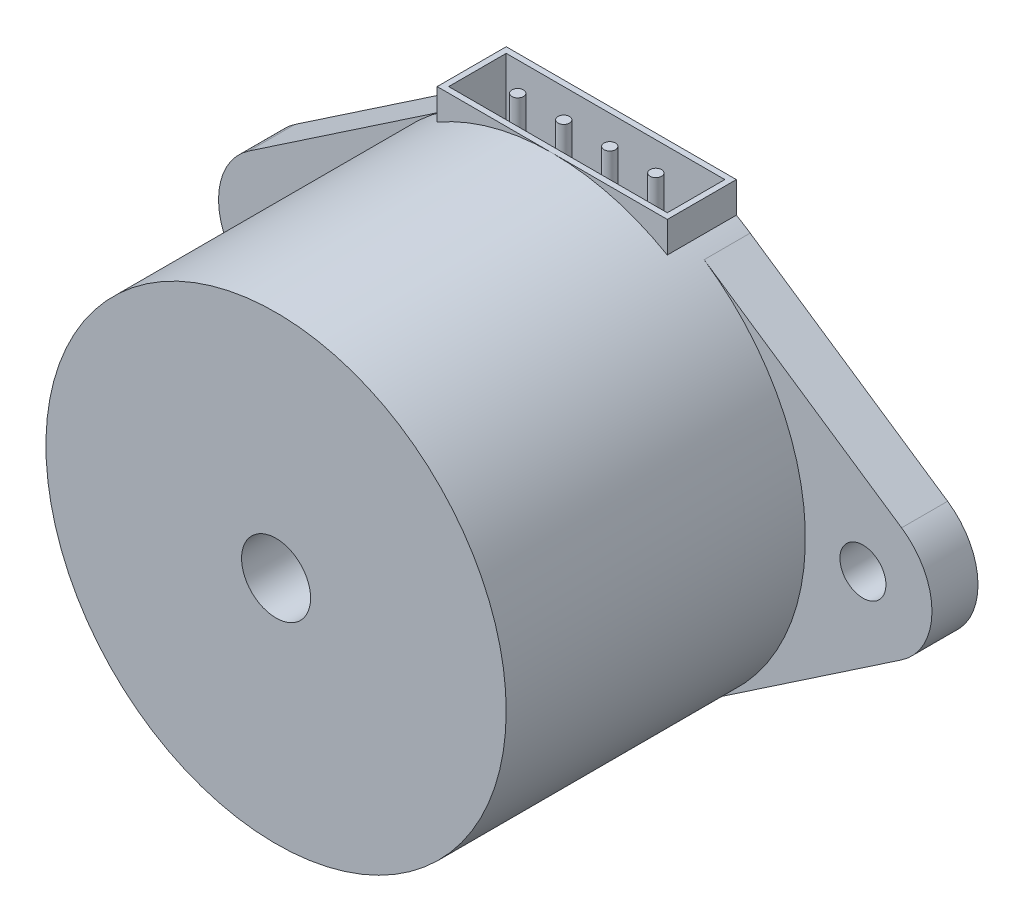
ISO-10303-21;
HEADER;
FILE_DESCRIPTION(('STEP AP214'),'2;1');
FILE_NAME('part.step','',(''),(''),'','','');
FILE_SCHEMA(('AUTOMOTIVE_DESIGN { 1 0 10303 214 1 1 1 1 }'));
ENDSEC;
DATA;
#1=APPLICATION_CONTEXT('core data for automotive mechanical design processes');
#2=APPLICATION_PROTOCOL_DEFINITION('international standard','automotive_design',2000,#1);
#3=PRODUCT_CONTEXT('',#1,'mechanical');
#4=PRODUCT('Part','Part','',(#3));
#5=PRODUCT_RELATED_PRODUCT_CATEGORY('part','',(#4));
#6=PRODUCT_DEFINITION_FORMATION('','',#4);
#7=PRODUCT_DEFINITION_CONTEXT('part definition',#1,'design');
#8=PRODUCT_DEFINITION('design','',#6,#7);
#9=PRODUCT_DEFINITION_SHAPE('','',#8);
#10=(LENGTH_UNIT() NAMED_UNIT(*) SI_UNIT(.MILLI.,.METRE.));
#11=(NAMED_UNIT(*) PLANE_ANGLE_UNIT() SI_UNIT($,.RADIAN.));
#12=(NAMED_UNIT(*) SI_UNIT($,.STERADIAN.) SOLID_ANGLE_UNIT());
#13=UNCERTAINTY_MEASURE_WITH_UNIT(LENGTH_MEASURE(1.E-05),#10,'distance_accuracy_value','');
#14=(GEOMETRIC_REPRESENTATION_CONTEXT(3) GLOBAL_UNCERTAINTY_ASSIGNED_CONTEXT((#13)) GLOBAL_UNIT_ASSIGNED_CONTEXT((#10,
#11,#12)) REPRESENTATION_CONTEXT('',''));
#15=CARTESIAN_POINT('',(0.,0.,0.));
#16=DIRECTION('',(0.,0.,1.));
#17=DIRECTION('',(1.,0.,0.));
#18=AXIS2_PLACEMENT_3D('',#15,#16,#17);
#19=CARTESIAN_POINT('',(0.,10.,0.));
#20=DIRECTION('',(0.,1.,0.));
#21=DIRECTION('',(0.,0.,1.));
#22=AXIS2_PLACEMENT_3D('',#19,#20,#21);
#23=PLANE('',#22);
#24=DIRECTION('',(-1.,0.,0.));
#25=VECTOR('',#24,1.);
#26=CARTESIAN_POINT('',(-5.,10.,0.));
#27=LINE('',#26,#25);
#28=CARTESIAN_POINT('',(5.,10.,0.));
#29=VERTEX_POINT('',#28);
#30=CARTESIAN_POINT('',(-5.,10.,0.));
#31=VERTEX_POINT('',#30);
#32=EDGE_CURVE('E248',#29,#31,#27,.T.);
#33=ORIENTED_EDGE('',*,*,#32,.T.);
#34=DIRECTION('',(0.,0.,1.));
#35=VECTOR('',#34,1.);
#36=CARTESIAN_POINT('',(-5.,10.,0.));
#37=LINE('',#36,#35);
#38=CARTESIAN_POINT('',(-5.,10.,3.));
#39=VERTEX_POINT('',#38);
#40=EDGE_CURVE('E230',#31,#39,#37,.T.);
#41=ORIENTED_EDGE('',*,*,#40,.T.);
#42=DIRECTION('',(1.,0.,0.));
#43=VECTOR('',#42,1.);
#44=CARTESIAN_POINT('',(-5.,10.,3.));
#45=LINE('',#44,#43);
#46=CARTESIAN_POINT('',(0.,10.,3.));
#47=VERTEX_POINT('',#46);
#48=EDGE_CURVE('E240',#39,#47,#45,.T.);
#49=ORIENTED_EDGE('',*,*,#48,.T.);
#50=CARTESIAN_POINT('',(5.,10.,3.));
#51=VERTEX_POINT('',#50);
#52=EDGE_CURVE('E239',#47,#51,#45,.T.);
#53=ORIENTED_EDGE('',*,*,#52,.T.);
#54=DIRECTION('',(0.,0.,-1.));
#55=VECTOR('',#54,1.);
#56=CARTESIAN_POINT('',(5.,10.,0.));
#57=LINE('',#56,#55);
#58=EDGE_CURVE('E244',#51,#29,#57,.T.);
#59=ORIENTED_EDGE('',*,*,#58,.T.);
#60=EDGE_LOOP('',(#33,#41,#49,#53,#59));
#61=FACE_BOUND('',#60,.T.);
#62=DIRECTION('',(1.,0.,0.));
#63=VECTOR('',#62,1.);
#64=CARTESIAN_POINT('',(0.,10.,0.25));
#65=LINE('',#64,#63);
#66=CARTESIAN_POINT('',(-4.75,10.,0.25));
#67=VERTEX_POINT('',#66);
#68=CARTESIAN_POINT('',(4.75,10.,0.25));
#69=VERTEX_POINT('',#68);
#70=EDGE_CURVE('E215',#67,#69,#65,.T.);
#71=ORIENTED_EDGE('',*,*,#70,.T.);
#72=DIRECTION('',(0.,0.,1.));
#73=VECTOR('',#72,1.);
#74=CARTESIAN_POINT('',(4.75,10.,0.));
#75=LINE('',#74,#73);
#76=CARTESIAN_POINT('',(4.75,10.,2.75));
#77=VERTEX_POINT('',#76);
#78=EDGE_CURVE('E60',#69,#77,#75,.T.);
#79=ORIENTED_EDGE('',*,*,#78,.T.);
#80=DIRECTION('',(1.,0.,0.));
#81=VECTOR('',#80,1.);
#82=CARTESIAN_POINT('',(0.,10.,2.75));
#83=LINE('',#82,#81);
#84=CARTESIAN_POINT('',(-4.75,10.,2.75));
#85=VERTEX_POINT('',#84);
#86=EDGE_CURVE('E222',#85,#77,#83,.T.);
#87=ORIENTED_EDGE('',*,*,#86,.F.);
#88=DIRECTION('',(0.,0.,1.));
#89=VECTOR('',#88,1.);
#90=CARTESIAN_POINT('',(-4.75,10.,0.));
#91=LINE('',#90,#89);
#92=EDGE_CURVE('E218',#67,#85,#91,.T.);
#93=ORIENTED_EDGE('',*,*,#92,.F.);
#94=EDGE_LOOP('',(#71,#79,#87,#93));
#95=FACE_BOUND('',#94,.T.);
#96=ADVANCED_FACE('F44',(#61,#95),#23,.T.);
#97=CARTESIAN_POINT('',(0.,0.,15.));
#98=DIRECTION('',(0.,0.,-1.));
#99=DIRECTION('',(-1.,0.,0.));
#100=AXIS2_PLACEMENT_3D('',#97,#98,#99);
#101=CYLINDRICAL_SURFACE('',#100,10.);
#102=CARTESIAN_POINT('',(0.,0.,0.));
#103=DIRECTION('',(0.,0.,1.));
#104=DIRECTION('',(1.,0.,0.));
#105=AXIS2_PLACEMENT_3D('',#102,#103,#104);
#106=CIRCLE('',#105,10.);
#107=CARTESIAN_POINT('',(5.59999996604207,8.28492607486053,0.));
#108=VERTEX_POINT('',#107);
#109=CARTESIAN_POINT('',(5.,8.66025403784439,0.));
#110=VERTEX_POINT('',#109);
#111=EDGE_CURVE('E367',#108,#110,#106,.T.);
#112=ORIENTED_EDGE('',*,*,#111,.T.);
#113=DIRECTION('',(0.,0.,-1.));
#114=VECTOR('',#113,1.);
#115=CARTESIAN_POINT('',(5.,8.66025403784438,15.));
#116=LINE('',#115,#114);
#117=CARTESIAN_POINT('',(5.,8.66025403784439,3.));
#118=VERTEX_POINT('',#117);
#119=EDGE_CURVE('E255',#110,#118,#116,.F.);
#120=ORIENTED_EDGE('',*,*,#119,.T.);
#121=CARTESIAN_POINT('',(0.,0.,3.));
#122=DIRECTION('',(0.,0.,1.));
#123=DIRECTION('',(1.,0.,0.));
#124=AXIS2_PLACEMENT_3D('',#121,#122,#123);
#125=CIRCLE('',#124,10.);
#126=EDGE_CURVE('E11',#118,#47,#125,.T.);
#127=ORIENTED_EDGE('',*,*,#126,.T.);
#128=CARTESIAN_POINT('',(-5.,8.66025403784439,3.));
#129=VERTEX_POINT('',#128);
#130=EDGE_CURVE('E48',#47,#129,#125,.T.);
#131=ORIENTED_EDGE('',*,*,#130,.T.);
#132=DIRECTION('',(0.,0.,-1.));
#133=VECTOR('',#132,1.);
#134=CARTESIAN_POINT('',(-5.,8.66025403784439,15.));
#135=LINE('',#134,#133);
#136=CARTESIAN_POINT('',(-5.,8.66025403784439,0.));
#137=VERTEX_POINT('',#136);
#138=EDGE_CURVE('E267',#129,#137,#135,.T.);
#139=ORIENTED_EDGE('',*,*,#138,.T.);
#140=CARTESIAN_POINT('',(-5.59999995723817,8.28492606183559,0.));
#141=VERTEX_POINT('',#140);
#142=EDGE_CURVE('E370',#137,#141,#106,.T.);
#143=ORIENTED_EDGE('',*,*,#142,.T.);
#144=DIRECTION('',(0.,0.,-1.));
#145=VECTOR('',#144,1.);
#146=CARTESIAN_POINT('',(-5.59999996604207,8.28492607486053,2.));
#147=LINE('',#146,#145);
#148=CARTESIAN_POINT('',(-5.59999995723817,8.28492606183559,2.));
#149=VERTEX_POINT('',#148);
#150=EDGE_CURVE('E353',#149,#141,#147,.T.);
#151=ORIENTED_EDGE('',*,*,#150,.F.);
#152=CARTESIAN_POINT('',(0.,0.,2.));
#153=DIRECTION('',(0.,0.,-1.));
#154=DIRECTION('',(-1.,0.,0.));
#155=AXIS2_PLACEMENT_3D('',#152,#153,#154);
#156=CIRCLE('',#155,10.);
#157=CARTESIAN_POINT('',(-5.59999995723811,-8.28492606183558,2.));
#158=VERTEX_POINT('',#157);
#159=EDGE_CURVE('E366',#158,#149,#156,.T.);
#160=ORIENTED_EDGE('',*,*,#159,.F.);
#161=DIRECTION('',(0.,0.,-1.));
#162=VECTOR('',#161,1.);
#163=CARTESIAN_POINT('',(-5.59999996604202,-8.28492607486053,2.));
#164=LINE('',#163,#162);
#165=CARTESIAN_POINT('',(-5.59999996604202,-8.28492607486053,0.));
#166=VERTEX_POINT('',#165);
#167=EDGE_CURVE('E334',#158,#166,#164,.T.);
#168=ORIENTED_EDGE('',*,*,#167,.T.);
#169=CARTESIAN_POINT('',(5.59999995723818,-8.28492606183553,0.));
#170=VERTEX_POINT('',#169);
#171=EDGE_CURVE('E338',#166,#170,#106,.T.);
#172=ORIENTED_EDGE('',*,*,#171,.T.);
#173=DIRECTION('',(0.,0.,-1.));
#174=VECTOR('',#173,1.);
#175=CARTESIAN_POINT('',(5.59999996604209,-8.28492607486049,2.));
#176=LINE('',#175,#174);
#177=CARTESIAN_POINT('',(5.599999974846,-8.28492608788544,2.));
#178=VERTEX_POINT('',#177);
#179=EDGE_CURVE('E339',#178,#170,#176,.T.);
#180=ORIENTED_EDGE('',*,*,#179,.F.);
#181=CARTESIAN_POINT('',(5.59999995723817,8.28492606183559,2.));
#182=VERTEX_POINT('',#181);
#183=EDGE_CURVE('E373',#182,#178,#156,.T.);
#184=ORIENTED_EDGE('',*,*,#183,.F.);
#185=DIRECTION('',(0.,0.,-1.));
#186=VECTOR('',#185,1.);
#187=CARTESIAN_POINT('',(5.59999996604207,8.28492607486053,2.));
#188=LINE('',#187,#186);
#189=EDGE_CURVE('E349',#182,#108,#188,.T.);
#190=ORIENTED_EDGE('',*,*,#189,.T.);
#191=EDGE_LOOP('',(#112,#120,#127,#131,#139,#143,#151,#160,#168,#172,#180,#184,#190));
#192=FACE_BOUND('',#191,.T.);
#193=CARTESIAN_POINT('',(0.,0.,15.));
#194=DIRECTION('',(0.,0.,1.));
#195=DIRECTION('',(1.,0.,0.));
#196=AXIS2_PLACEMENT_3D('',#193,#194,#195);
#197=CIRCLE('',#196,10.);
#198=CARTESIAN_POINT('',(10.,0.,15.));
#199=VERTEX_POINT('',#198);
#200=EDGE_CURVE('E362',#199,#199,#197,.T.);
#201=ORIENTED_EDGE('',*,*,#200,.F.);
#202=EDGE_LOOP('',(#201));
#203=FACE_BOUND('',#202,.T.);
#204=ADVANCED_FACE('F46',(#192,#203),#101,.T.);
#205=CARTESIAN_POINT('',(0.,0.,15.));
#206=DIRECTION('',(0.,0.,1.));
#207=DIRECTION('',(1.,0.,0.));
#208=AXIS2_PLACEMENT_3D('',#205,#206,#207);
#209=PLANE('',#208);
#210=CARTESIAN_POINT('',(0.,0.,15.));
#211=DIRECTION('',(0.,0.,1.));
#212=DIRECTION('',(1.,0.,0.));
#213=AXIS2_PLACEMENT_3D('',#210,#211,#212);
#214=CIRCLE('',#213,1.5);
#215=CARTESIAN_POINT('',(1.5,0.,15.));
#216=VERTEX_POINT('',#215);
#217=EDGE_CURVE('E500',#216,#216,#214,.T.);
#218=ORIENTED_EDGE('',*,*,#217,.F.);
#219=EDGE_LOOP('',(#218));
#220=FACE_BOUND('',#219,.T.);
#221=ORIENTED_EDGE('',*,*,#200,.T.);
#222=EDGE_LOOP('',(#221));
#223=FACE_BOUND('',#222,.T.);
#224=ADVANCED_FACE('F440',(#220,#223),#209,.T.);
#225=CARTESIAN_POINT('',(0.,0.,0.));
#226=DIRECTION('',(0.,0.,1.));
#227=DIRECTION('',(1.,0.,0.));
#228=AXIS2_PLACEMENT_3D('',#225,#226,#227);
#229=PLANE('',#228);
#230=ORIENTED_EDGE('',*,*,#142,.F.);
#231=DIRECTION('',(0.,1.,0.));
#232=VECTOR('',#231,1.);
#233=CARTESIAN_POINT('',(-5.,8.,0.));
#234=LINE('',#233,#232);
#235=EDGE_CURVE('E251',#137,#31,#234,.T.);
#236=ORIENTED_EDGE('',*,*,#235,.T.);
#237=ORIENTED_EDGE('',*,*,#32,.F.);
#238=DIRECTION('',(0.,1.,0.));
#239=VECTOR('',#238,1.);
#240=CARTESIAN_POINT('',(5.,8.,0.));
#241=LINE('',#240,#239);
#242=EDGE_CURVE('E256',#110,#29,#241,.T.);
#243=ORIENTED_EDGE('',*,*,#242,.F.);
#244=ORIENTED_EDGE('',*,*,#111,.F.);
#245=DIRECTION('',(0.828492608788547,-0.559999997484597,0.));
#246=VECTOR('',#245,1.);
#247=CARTESIAN_POINT('',(5.59999995723817,8.28492606183559,0.));
#248=LINE('',#247,#246);
#249=CARTESIAN_POINT('',(14.1799998731342,2.48547764983827,0.));
#250=VERTEX_POINT('',#249);
#251=EDGE_CURVE('E315',#108,#250,#248,.T.);
#252=ORIENTED_EDGE('',*,*,#251,.T.);
#253=CARTESIAN_POINT('',(12.5,0.,0.));
#254=DIRECTION('',(0.,0.,-1.));
#255=DIRECTION('',(-1.,0.,0.));
#256=AXIS2_PLACEMENT_3D('',#253,#254,#255);
#257=CIRCLE('',#256,2.99999957385878);
#258=CARTESIAN_POINT('',(14.1799998731343,-2.48547764983815,0.));
#259=VERTEX_POINT('',#258);
#260=EDGE_CURVE('E319',#250,#259,#257,.T.);
#261=ORIENTED_EDGE('',*,*,#260,.T.);
#262=DIRECTION('',(0.828492608788544,0.5599999974846,0.));
#263=VECTOR('',#262,1.);
#264=CARTESIAN_POINT('',(5.59999995723818,-8.28492606183553,0.));
#265=LINE('',#264,#263);
#266=EDGE_CURVE('E323',#170,#259,#265,.T.);
#267=ORIENTED_EDGE('',*,*,#266,.F.);
#268=ORIENTED_EDGE('',*,*,#171,.F.);
#269=DIRECTION('',(-0.828492608788549,0.559999997484593,0.));
#270=VECTOR('',#269,1.);
#271=CARTESIAN_POINT('',(-5.59999995723811,-8.28492606183558,0.));
#272=LINE('',#271,#270);
#273=CARTESIAN_POINT('',(-14.1799998731342,-2.48547764983826,0.));
#274=VERTEX_POINT('',#273);
#275=EDGE_CURVE('E271',#166,#274,#272,.T.);
#276=ORIENTED_EDGE('',*,*,#275,.T.);
#277=CARTESIAN_POINT('',(-12.5,0.,0.));
#278=DIRECTION('',(0.,0.,-1.));
#279=DIRECTION('',(-1.,0.,0.));
#280=AXIS2_PLACEMENT_3D('',#277,#278,#279);
#281=CIRCLE('',#280,2.99999957385878);
#282=CARTESIAN_POINT('',(-14.1799998731342,2.48547764983825,0.));
#283=VERTEX_POINT('',#282);
#284=EDGE_CURVE('E307',#274,#283,#281,.T.);
#285=ORIENTED_EDGE('',*,*,#284,.T.);
#286=DIRECTION('',(-0.828492608788547,-0.559999997484597,0.));
#287=VECTOR('',#286,1.);
#288=CARTESIAN_POINT('',(-5.59999995723817,8.28492606183559,0.));
#289=LINE('',#288,#287);
#290=EDGE_CURVE('E311',#141,#283,#289,.T.);
#291=ORIENTED_EDGE('',*,*,#290,.F.);
#292=EDGE_LOOP('',(#230,#236,#237,#243,#244,#252,#261,#267,#268,#276,#285,#291));
#293=FACE_BOUND('',#292,.T.);
#294=CARTESIAN_POINT('',(-12.5,0.,0.));
#295=DIRECTION('',(0.,0.,-1.));
#296=DIRECTION('',(-1.,0.,0.));
#297=AXIS2_PLACEMENT_3D('',#294,#295,#296);
#298=CIRCLE('',#297,1.);
#299=CARTESIAN_POINT('',(-13.5,0.,0.));
#300=VERTEX_POINT('',#299);
#301=EDGE_CURVE('E277',#300,#300,#298,.T.);
#302=ORIENTED_EDGE('',*,*,#301,.F.);
#303=EDGE_LOOP('',(#302));
#304=FACE_BOUND('',#303,.T.);
#305=CARTESIAN_POINT('',(12.5,0.,0.));
#306=DIRECTION('',(0.,0.,-1.));
#307=DIRECTION('',(-1.,0.,0.));
#308=AXIS2_PLACEMENT_3D('',#305,#306,#307);
#309=CIRCLE('',#308,1.);
#310=CARTESIAN_POINT('',(11.5,0.,0.));
#311=VERTEX_POINT('',#310);
#312=EDGE_CURVE('E327',#311,#311,#309,.T.);
#313=ORIENTED_EDGE('',*,*,#312,.F.);
#314=EDGE_LOOP('',(#313));
#315=FACE_BOUND('',#314,.T.);
#316=ADVANCED_FACE('F402',(#293,#304,#315),#229,.F.);
#317=CARTESIAN_POINT('',(-12.5,0.,2.));
#318=DIRECTION('',(0.,0.,-1.));
#319=DIRECTION('',(-1.,0.,0.));
#320=AXIS2_PLACEMENT_3D('',#317,#318,#319);
#321=CYLINDRICAL_SURFACE('',#320,1.);
#322=CARTESIAN_POINT('',(-12.5,0.,2.));
#323=DIRECTION('',(0.,0.,-1.));
#324=DIRECTION('',(-1.,0.,0.));
#325=AXIS2_PLACEMENT_3D('',#322,#323,#324);
#326=CIRCLE('',#325,1.);
#327=CARTESIAN_POINT('',(-13.5,0.,2.));
#328=VERTEX_POINT('',#327);
#329=EDGE_CURVE('E299',#328,#328,#326,.T.);
#330=ORIENTED_EDGE('',*,*,#329,.F.);
#331=EDGE_LOOP('',(#330));
#332=FACE_BOUND('',#331,.T.);
#333=ORIENTED_EDGE('',*,*,#301,.T.);
#334=EDGE_LOOP('',(#333));
#335=FACE_BOUND('',#334,.T.);
#336=ADVANCED_FACE('F734',(#332,#335),#321,.F.);
#337=CARTESIAN_POINT('',(-12.5,0.,2.));
#338=DIRECTION('',(0.,0.,-1.));
#339=DIRECTION('',(-1.,0.,0.));
#340=AXIS2_PLACEMENT_3D('',#337,#338,#339);
#341=CYLINDRICAL_SURFACE('',#340,2.99999957385878);
#342=ORIENTED_EDGE('',*,*,#284,.F.);
#343=DIRECTION('',(0.,0.,-1.));
#344=VECTOR('',#343,1.);
#345=CARTESIAN_POINT('',(-14.1799998731342,-2.48547764983826,2.));
#346=LINE('',#345,#344);
#347=CARTESIAN_POINT('',(-14.1799998731342,-2.48547764983826,2.));
#348=VERTEX_POINT('',#347);
#349=EDGE_CURVE('E303',#348,#274,#346,.T.);
#350=ORIENTED_EDGE('',*,*,#349,.F.);
#351=CARTESIAN_POINT('',(-12.5,0.,2.));
#352=DIRECTION('',(0.,0.,-1.));
#353=DIRECTION('',(-1.,0.,0.));
#354=AXIS2_PLACEMENT_3D('',#351,#352,#353);
#355=CIRCLE('',#354,2.99999957385878);
#356=CARTESIAN_POINT('',(-14.1799998731342,2.48547764983825,2.));
#357=VERTEX_POINT('',#356);
#358=EDGE_CURVE('E276',#348,#357,#355,.T.);
#359=ORIENTED_EDGE('',*,*,#358,.T.);
#360=DIRECTION('',(0.,0.,-1.));
#361=VECTOR('',#360,1.);
#362=CARTESIAN_POINT('',(-14.1799998731342,2.48547764983825,2.));
#363=LINE('',#362,#361);
#364=EDGE_CURVE('E357',#357,#283,#363,.T.);
#365=ORIENTED_EDGE('',*,*,#364,.T.);
#366=EDGE_LOOP('',(#342,#350,#359,#365));
#367=FACE_BOUND('',#366,.T.);
#368=ADVANCED_FACE('F726',(#367),#341,.T.);
#369=CARTESIAN_POINT('',(0.,0.,2.));
#370=DIRECTION('',(0.,0.,-1.));
#371=DIRECTION('',(-1.,0.,0.));
#372=AXIS2_PLACEMENT_3D('',#369,#370,#371);
#373=PLANE('',#372);
#374=DIRECTION('',(-0.828492608788549,0.559999997484593,0.));
#375=VECTOR('',#374,1.);
#376=CARTESIAN_POINT('',(-5.59999995723811,-8.28492606183558,2.));
#377=LINE('',#376,#375);
#378=EDGE_CURVE('E272',#158,#348,#377,.T.);
#379=ORIENTED_EDGE('',*,*,#378,.F.);
#380=ORIENTED_EDGE('',*,*,#159,.T.);
#381=DIRECTION('',(-0.828492608788547,-0.559999997484597,0.));
#382=VECTOR('',#381,1.);
#383=CARTESIAN_POINT('',(-5.59999995723817,8.28492606183559,2.));
#384=LINE('',#383,#382);
#385=EDGE_CURVE('E281',#149,#357,#384,.T.);
#386=ORIENTED_EDGE('',*,*,#385,.T.);
#387=ORIENTED_EDGE('',*,*,#358,.F.);
#388=EDGE_LOOP('',(#379,#380,#386,#387));
#389=FACE_BOUND('',#388,.T.);
#390=ORIENTED_EDGE('',*,*,#329,.T.);
#391=EDGE_LOOP('',(#390));
#392=FACE_BOUND('',#391,.T.);
#393=ADVANCED_FACE('F698',(#389,#392),#373,.F.);
#394=CARTESIAN_POINT('',(-5.59999995723817,8.28492606183559,2.));
#395=DIRECTION('',(0.559999997484597,-0.828492608788547,0.));
#396=DIRECTION('',(0.828492608788547,0.559999997484597,0.));
#397=AXIS2_PLACEMENT_3D('',#394,#395,#396);
#398=PLANE('',#397);
#399=ORIENTED_EDGE('',*,*,#290,.T.);
#400=ORIENTED_EDGE('',*,*,#364,.F.);
#401=ORIENTED_EDGE('',*,*,#385,.F.);
#402=ORIENTED_EDGE('',*,*,#150,.T.);
#403=EDGE_LOOP('',(#399,#400,#401,#402));
#404=FACE_BOUND('',#403,.T.);
#405=ADVANCED_FACE('F706',(#404),#398,.F.);
#406=CARTESIAN_POINT('',(-5.59999995723811,-8.28492606183558,2.));
#407=DIRECTION('',(-0.559999997484593,-0.828492608788549,0.));
#408=DIRECTION('',(0.828492608788549,-0.559999997484593,0.));
#409=AXIS2_PLACEMENT_3D('',#406,#407,#408);
#410=PLANE('',#409);
#411=ORIENTED_EDGE('',*,*,#275,.F.);
#412=ORIENTED_EDGE('',*,*,#167,.F.);
#413=ORIENTED_EDGE('',*,*,#378,.T.);
#414=ORIENTED_EDGE('',*,*,#349,.T.);
#415=EDGE_LOOP('',(#411,#412,#413,#414));
#416=FACE_BOUND('',#415,.T.);
#417=ADVANCED_FACE('F695',(#416),#410,.T.);
#418=CARTESIAN_POINT('',(12.5,0.,2.));
#419=DIRECTION('',(0.,0.,-1.));
#420=DIRECTION('',(-1.,0.,0.));
#421=AXIS2_PLACEMENT_3D('',#418,#419,#420);
#422=CIRCLE('',#421,1.);
#423=CARTESIAN_POINT('',(11.5,0.,2.));
#424=VERTEX_POINT('',#423);
#425=EDGE_CURVE('E295',#424,#424,#422,.T.);
#426=ORIENTED_EDGE('',*,*,#425,.T.);
#427=EDGE_LOOP('',(#426));
#428=FACE_BOUND('',#427,.T.);
#429=DIRECTION('',(0.828492608788547,-0.559999997484597,0.));
#430=VECTOR('',#429,1.);
#431=CARTESIAN_POINT('',(5.59999995723817,8.28492606183559,2.));
#432=LINE('',#431,#430);
#433=CARTESIAN_POINT('',(14.1799998731342,2.48547764983827,2.));
#434=VERTEX_POINT('',#433);
#435=EDGE_CURVE('E284',#182,#434,#432,.T.);
#436=ORIENTED_EDGE('',*,*,#435,.F.);
#437=ORIENTED_EDGE('',*,*,#183,.T.);
#438=DIRECTION('',(0.828492608788544,0.5599999974846,0.));
#439=VECTOR('',#438,1.);
#440=CARTESIAN_POINT('',(5.59999995723818,-8.28492606183553,2.));
#441=LINE('',#440,#439);
#442=CARTESIAN_POINT('',(14.1799998731343,-2.48547764983815,2.));
#443=VERTEX_POINT('',#442);
#444=EDGE_CURVE('E292',#178,#443,#441,.T.);
#445=ORIENTED_EDGE('',*,*,#444,.T.);
#446=CARTESIAN_POINT('',(12.5,0.,2.));
#447=DIRECTION('',(0.,0.,-1.));
#448=DIRECTION('',(-1.,0.,0.));
#449=AXIS2_PLACEMENT_3D('',#446,#447,#448);
#450=CIRCLE('',#449,2.99999957385878);
#451=EDGE_CURVE('E288',#434,#443,#450,.T.);
#452=ORIENTED_EDGE('',*,*,#451,.F.);
#453=EDGE_LOOP('',(#436,#437,#445,#452));
#454=FACE_BOUND('',#453,.T.);
#455=ADVANCED_FACE('F419',(#428,#454),#373,.F.);
#456=CARTESIAN_POINT('',(5.59999995723818,-8.28492606183553,2.));
#457=DIRECTION('',(-0.5599999974846,0.828492608788544,0.));
#458=DIRECTION('',(-0.828492608788544,-0.5599999974846,0.));
#459=AXIS2_PLACEMENT_3D('',#456,#457,#458);
#460=PLANE('',#459);
#461=ORIENTED_EDGE('',*,*,#266,.T.);
#462=DIRECTION('',(0.,0.,-1.));
#463=VECTOR('',#462,1.);
#464=CARTESIAN_POINT('',(14.1799998731343,-2.48547764983815,2.));
#465=LINE('',#464,#463);
#466=EDGE_CURVE('E343',#443,#259,#465,.T.);
#467=ORIENTED_EDGE('',*,*,#466,.F.);
#468=ORIENTED_EDGE('',*,*,#444,.F.);
#469=ORIENTED_EDGE('',*,*,#179,.T.);
#470=EDGE_LOOP('',(#461,#467,#468,#469));
#471=FACE_BOUND('',#470,.T.);
#472=ADVANCED_FACE('F412',(#471),#460,.F.);
#473=CARTESIAN_POINT('',(12.5,0.,2.));
#474=DIRECTION('',(0.,0.,-1.));
#475=DIRECTION('',(-1.,0.,0.));
#476=AXIS2_PLACEMENT_3D('',#473,#474,#475);
#477=CYLINDRICAL_SURFACE('',#476,2.99999957385878);
#478=ORIENTED_EDGE('',*,*,#260,.F.);
#479=DIRECTION('',(0.,0.,-1.));
#480=VECTOR('',#479,1.);
#481=CARTESIAN_POINT('',(14.1799998731342,2.48547764983827,2.));
#482=LINE('',#481,#480);
#483=EDGE_CURVE('E346',#434,#250,#482,.T.);
#484=ORIENTED_EDGE('',*,*,#483,.F.);
#485=ORIENTED_EDGE('',*,*,#451,.T.);
#486=ORIENTED_EDGE('',*,*,#466,.T.);
#487=EDGE_LOOP('',(#478,#484,#485,#486));
#488=FACE_BOUND('',#487,.T.);
#489=ADVANCED_FACE('F417',(#488),#477,.T.);
#490=CARTESIAN_POINT('',(5.59999995723817,8.28492606183559,2.));
#491=DIRECTION('',(0.559999997484597,0.828492608788547,0.));
#492=DIRECTION('',(-0.828492608788547,0.559999997484597,0.));
#493=AXIS2_PLACEMENT_3D('',#490,#491,#492);
#494=PLANE('',#493);
#495=ORIENTED_EDGE('',*,*,#251,.F.);
#496=ORIENTED_EDGE('',*,*,#189,.F.);
#497=ORIENTED_EDGE('',*,*,#435,.T.);
#498=ORIENTED_EDGE('',*,*,#483,.T.);
#499=EDGE_LOOP('',(#495,#496,#497,#498));
#500=FACE_BOUND('',#499,.T.);
#501=ADVANCED_FACE('F422',(#500),#494,.T.);
#502=CARTESIAN_POINT('',(12.5,0.,2.));
#503=DIRECTION('',(0.,0.,-1.));
#504=DIRECTION('',(-1.,0.,0.));
#505=AXIS2_PLACEMENT_3D('',#502,#503,#504);
#506=CYLINDRICAL_SURFACE('',#505,1.);
#507=ORIENTED_EDGE('',*,*,#425,.F.);
#508=EDGE_LOOP('',(#507));
#509=FACE_BOUND('',#508,.T.);
#510=ORIENTED_EDGE('',*,*,#312,.T.);
#511=EDGE_LOOP('',(#510));
#512=FACE_BOUND('',#511,.T.);
#513=ADVANCED_FACE('F652',(#509,#512),#506,.F.);
#514=CARTESIAN_POINT('',(-5.,8.,3.));
#515=DIRECTION('',(0.,0.,1.));
#516=DIRECTION('',(1.,0.,0.));
#517=AXIS2_PLACEMENT_3D('',#514,#515,#516);
#518=PLANE('',#517);
#519=ORIENTED_EDGE('',*,*,#126,.F.);
#520=DIRECTION('',(0.,1.,0.));
#521=VECTOR('',#520,1.);
#522=CARTESIAN_POINT('',(5.,8.,3.));
#523=LINE('',#522,#521);
#524=EDGE_CURVE('E259',#118,#51,#523,.T.);
#525=ORIENTED_EDGE('',*,*,#524,.T.);
#526=ORIENTED_EDGE('',*,*,#52,.F.);
#527=EDGE_LOOP('',(#519,#525,#526));
#528=FACE_BOUND('',#527,.T.);
#529=ADVANCED_FACE('F391',(#528),#518,.T.);
#530=CARTESIAN_POINT('',(-5.,8.,0.));
#531=DIRECTION('',(-1.,0.,0.));
#532=DIRECTION('',(0.,0.,1.));
#533=AXIS2_PLACEMENT_3D('',#530,#531,#532);
#534=PLANE('',#533);
#535=ORIENTED_EDGE('',*,*,#138,.F.);
#536=DIRECTION('',(0.,1.,0.));
#537=VECTOR('',#536,1.);
#538=CARTESIAN_POINT('',(-5.,8.,3.));
#539=LINE('',#538,#537);
#540=EDGE_CURVE('E68',#129,#39,#539,.T.);
#541=ORIENTED_EDGE('',*,*,#540,.T.);
#542=ORIENTED_EDGE('',*,*,#40,.F.);
#543=ORIENTED_EDGE('',*,*,#235,.F.);
#544=EDGE_LOOP('',(#535,#541,#542,#543));
#545=FACE_BOUND('',#544,.T.);
#546=ADVANCED_FACE('F400',(#545),#534,.T.);
#547=CARTESIAN_POINT('',(5.,8.,0.));
#548=DIRECTION('',(1.,0.,0.));
#549=DIRECTION('',(0.,0.,-1.));
#550=AXIS2_PLACEMENT_3D('',#547,#548,#549);
#551=PLANE('',#550);
#552=ORIENTED_EDGE('',*,*,#119,.F.);
#553=ORIENTED_EDGE('',*,*,#242,.T.);
#554=ORIENTED_EDGE('',*,*,#58,.F.);
#555=ORIENTED_EDGE('',*,*,#524,.F.);
#556=EDGE_LOOP('',(#552,#553,#554,#555));
#557=FACE_BOUND('',#556,.T.);
#558=ADVANCED_FACE('F424',(#557),#551,.T.);
#559=ORIENTED_EDGE('',*,*,#130,.F.);
#560=ORIENTED_EDGE('',*,*,#48,.F.);
#561=ORIENTED_EDGE('',*,*,#540,.F.);
#562=EDGE_LOOP('',(#559,#560,#561));
#563=FACE_BOUND('',#562,.T.);
#564=ADVANCED_FACE('F388',(#563),#518,.T.);
#565=CARTESIAN_POINT('',(4.75,7.,0.));
#566=DIRECTION('',(-1.,0.,0.));
#567=DIRECTION('',(0.,0.,1.));
#568=AXIS2_PLACEMENT_3D('',#565,#566,#567);
#569=PLANE('',#568);
#570=ORIENTED_EDGE('',*,*,#78,.F.);
#571=DIRECTION('',(0.,1.,0.));
#572=VECTOR('',#571,1.);
#573=CARTESIAN_POINT('',(4.75,7.,0.25));
#574=LINE('',#573,#572);
#575=CARTESIAN_POINT('',(4.75,7.,0.25));
#576=VERTEX_POINT('',#575);
#577=EDGE_CURVE('E164',#576,#69,#574,.T.);
#578=ORIENTED_EDGE('',*,*,#577,.F.);
#579=DIRECTION('',(0.,0.,1.));
#580=VECTOR('',#579,1.);
#581=CARTESIAN_POINT('',(4.75,7.,0.));
#582=LINE('',#581,#580);
#583=CARTESIAN_POINT('',(4.75,7.,2.75));
#584=VERTEX_POINT('',#583);
#585=EDGE_CURVE('E173',#576,#584,#582,.T.);
#586=ORIENTED_EDGE('',*,*,#585,.T.);
#587=DIRECTION('',(0.,1.,0.));
#588=VECTOR('',#587,1.);
#589=CARTESIAN_POINT('',(4.75,7.,2.75));
#590=LINE('',#589,#588);
#591=EDGE_CURVE('E227',#584,#77,#590,.T.);
#592=ORIENTED_EDGE('',*,*,#591,.T.);
#593=EDGE_LOOP('',(#570,#578,#586,#592));
#594=FACE_BOUND('',#593,.T.);
#595=ADVANCED_FACE('F175',(#594),#569,.T.);
#596=CARTESIAN_POINT('',(0.,7.,2.75));
#597=DIRECTION('',(0.,0.,1.));
#598=DIRECTION('',(1.,0.,0.));
#599=AXIS2_PLACEMENT_3D('',#596,#597,#598);
#600=PLANE('',#599);
#601=ORIENTED_EDGE('',*,*,#86,.T.);
#602=ORIENTED_EDGE('',*,*,#591,.F.);
#603=DIRECTION('',(1.,0.,0.));
#604=VECTOR('',#603,1.);
#605=CARTESIAN_POINT('',(0.,7.,2.75));
#606=LINE('',#605,#604);
#607=CARTESIAN_POINT('',(-4.75,7.,2.75));
#608=VERTEX_POINT('',#607);
#609=EDGE_CURVE('E178',#608,#584,#606,.T.);
#610=ORIENTED_EDGE('',*,*,#609,.F.);
#611=DIRECTION('',(0.,1.,0.));
#612=VECTOR('',#611,1.);
#613=CARTESIAN_POINT('',(-4.75,7.,2.75));
#614=LINE('',#613,#612);
#615=EDGE_CURVE('E231',#608,#85,#614,.T.);
#616=ORIENTED_EDGE('',*,*,#615,.T.);
#617=EDGE_LOOP('',(#601,#602,#610,#616));
#618=FACE_BOUND('',#617,.T.);
#619=ADVANCED_FACE('F481',(#618),#600,.F.);
#620=CARTESIAN_POINT('',(-4.75,7.,0.));
#621=DIRECTION('',(-1.,0.,0.));
#622=DIRECTION('',(0.,0.,1.));
#623=AXIS2_PLACEMENT_3D('',#620,#621,#622);
#624=PLANE('',#623);
#625=ORIENTED_EDGE('',*,*,#92,.T.);
#626=ORIENTED_EDGE('',*,*,#615,.F.);
#627=DIRECTION('',(0.,0.,1.));
#628=VECTOR('',#627,1.);
#629=CARTESIAN_POINT('',(-4.75,7.,0.));
#630=LINE('',#629,#628);
#631=CARTESIAN_POINT('',(-4.75,7.,0.25));
#632=VERTEX_POINT('',#631);
#633=EDGE_CURVE('E172',#632,#608,#630,.T.);
#634=ORIENTED_EDGE('',*,*,#633,.F.);
#635=DIRECTION('',(0.,1.,0.));
#636=VECTOR('',#635,1.);
#637=CARTESIAN_POINT('',(-4.75,7.,0.25));
#638=LINE('',#637,#636);
#639=EDGE_CURVE('E166',#632,#67,#638,.T.);
#640=ORIENTED_EDGE('',*,*,#639,.T.);
#641=EDGE_LOOP('',(#625,#626,#634,#640));
#642=FACE_BOUND('',#641,.T.);
#643=ADVANCED_FACE('F478',(#642),#624,.F.);
#644=CARTESIAN_POINT('',(-3.,7.,1.5));
#645=DIRECTION('',(0.,1.,0.));
#646=DIRECTION('',(0.,0.,1.));
#647=AXIS2_PLACEMENT_3D('',#644,#645,#646);
#648=CYLINDRICAL_SURFACE('',#647,0.25);
#649=CARTESIAN_POINT('',(-3.,7.,1.5));
#650=DIRECTION('',(0.,1.,0.));
#651=DIRECTION('',(0.,0.,1.));
#652=AXIS2_PLACEMENT_3D('',#649,#650,#651);
#653=CIRCLE('',#652,0.25);
#654=CARTESIAN_POINT('',(-3.,7.,1.75));
#655=VERTEX_POINT('',#654);
#656=EDGE_CURVE('E184',#655,#655,#653,.T.);
#657=ORIENTED_EDGE('',*,*,#656,.T.);
#658=EDGE_LOOP('',(#657));
#659=FACE_BOUND('',#658,.T.);
#660=CARTESIAN_POINT('',(-3.,10.,1.5));
#661=DIRECTION('',(0.,1.,0.));
#662=DIRECTION('',(0.,0.,1.));
#663=AXIS2_PLACEMENT_3D('',#660,#661,#662);
#664=CIRCLE('',#663,0.25);
#665=CARTESIAN_POINT('',(-3.,10.,1.75));
#666=VERTEX_POINT('',#665);
#667=EDGE_CURVE('E209',#666,#666,#664,.T.);
#668=ORIENTED_EDGE('',*,*,#667,.F.);
#669=EDGE_LOOP('',(#668));
#670=FACE_BOUND('',#669,.T.);
#671=ADVANCED_FACE('F474',(#659,#670),#648,.T.);
#672=CARTESIAN_POINT('',(3.,7.,1.5));
#673=DIRECTION('',(0.,1.,0.));
#674=DIRECTION('',(0.,0.,1.));
#675=AXIS2_PLACEMENT_3D('',#672,#673,#674);
#676=CYLINDRICAL_SURFACE('',#675,0.25);
#677=CARTESIAN_POINT('',(3.,7.,1.5));
#678=DIRECTION('',(0.,1.,0.));
#679=DIRECTION('',(0.,0.,1.));
#680=AXIS2_PLACEMENT_3D('',#677,#678,#679);
#681=CIRCLE('',#680,0.25);
#682=CARTESIAN_POINT('',(3.,7.,1.75));
#683=VERTEX_POINT('',#682);
#684=EDGE_CURVE('E188',#683,#683,#681,.T.);
#685=ORIENTED_EDGE('',*,*,#684,.T.);
#686=EDGE_LOOP('',(#685));
#687=FACE_BOUND('',#686,.T.);
#688=CARTESIAN_POINT('',(3.,10.,1.5));
#689=DIRECTION('',(0.,1.,0.));
#690=DIRECTION('',(0.,0.,1.));
#691=AXIS2_PLACEMENT_3D('',#688,#689,#690);
#692=CIRCLE('',#691,0.25);
#693=CARTESIAN_POINT('',(3.,10.,1.75));
#694=VERTEX_POINT('',#693);
#695=EDGE_CURVE('E205',#694,#694,#692,.T.);
#696=ORIENTED_EDGE('',*,*,#695,.F.);
#697=EDGE_LOOP('',(#696));
#698=FACE_BOUND('',#697,.T.);
#699=ADVANCED_FACE('F467',(#687,#698),#676,.T.);
#700=CARTESIAN_POINT('',(1.,7.,1.5));
#701=DIRECTION('',(0.,1.,0.));
#702=DIRECTION('',(0.,0.,1.));
#703=AXIS2_PLACEMENT_3D('',#700,#701,#702);
#704=CYLINDRICAL_SURFACE('',#703,0.25);
#705=CARTESIAN_POINT('',(1.,7.,1.5));
#706=DIRECTION('',(0.,1.,0.));
#707=DIRECTION('',(0.,0.,1.));
#708=AXIS2_PLACEMENT_3D('',#705,#706,#707);
#709=CIRCLE('',#708,0.25);
#710=CARTESIAN_POINT('',(1.,7.,1.75));
#711=VERTEX_POINT('',#710);
#712=EDGE_CURVE('E508',#711,#711,#709,.T.);
#713=ORIENTED_EDGE('',*,*,#712,.T.);
#714=EDGE_LOOP('',(#713));
#715=FACE_BOUND('',#714,.T.);
#716=CARTESIAN_POINT('',(1.,10.,1.5));
#717=DIRECTION('',(0.,1.,0.));
#718=DIRECTION('',(0.,0.,1.));
#719=AXIS2_PLACEMENT_3D('',#716,#717,#718);
#720=CIRCLE('',#719,0.25);
#721=CARTESIAN_POINT('',(1.,10.,1.75));
#722=VERTEX_POINT('',#721);
#723=EDGE_CURVE('E200',#722,#722,#720,.T.);
#724=ORIENTED_EDGE('',*,*,#723,.F.);
#725=EDGE_LOOP('',(#724));
#726=FACE_BOUND('',#725,.T.);
#727=ADVANCED_FACE('F460',(#715,#726),#704,.T.);
#728=CARTESIAN_POINT('',(-1.,7.,1.5));
#729=DIRECTION('',(0.,1.,0.));
#730=DIRECTION('',(0.,0.,1.));
#731=AXIS2_PLACEMENT_3D('',#728,#729,#730);
#732=CYLINDRICAL_SURFACE('',#731,0.25);
#733=CARTESIAN_POINT('',(-1.,7.,1.5));
#734=DIRECTION('',(0.,1.,0.));
#735=DIRECTION('',(0.,0.,1.));
#736=AXIS2_PLACEMENT_3D('',#733,#734,#735);
#737=CIRCLE('',#736,0.25);
#738=CARTESIAN_POINT('',(-1.,7.,1.75));
#739=VERTEX_POINT('',#738);
#740=EDGE_CURVE('E226',#739,#739,#737,.T.);
#741=ORIENTED_EDGE('',*,*,#740,.T.);
#742=EDGE_LOOP('',(#741));
#743=FACE_BOUND('',#742,.T.);
#744=CARTESIAN_POINT('',(-1.,10.,1.5));
#745=DIRECTION('',(0.,1.,0.));
#746=DIRECTION('',(0.,0.,1.));
#747=AXIS2_PLACEMENT_3D('',#744,#745,#746);
#748=CIRCLE('',#747,0.25);
#749=CARTESIAN_POINT('',(-1.,10.,1.75));
#750=VERTEX_POINT('',#749);
#751=EDGE_CURVE('E196',#750,#750,#748,.T.);
#752=ORIENTED_EDGE('',*,*,#751,.F.);
#753=EDGE_LOOP('',(#752));
#754=FACE_BOUND('',#753,.T.);
#755=ADVANCED_FACE('F458',(#743,#754),#732,.T.);
#756=CARTESIAN_POINT('',(0.,7.,0.25));
#757=DIRECTION('',(0.,0.,1.));
#758=DIRECTION('',(1.,0.,0.));
#759=AXIS2_PLACEMENT_3D('',#756,#757,#758);
#760=PLANE('',#759);
#761=ORIENTED_EDGE('',*,*,#70,.F.);
#762=ORIENTED_EDGE('',*,*,#639,.F.);
#763=DIRECTION('',(1.,0.,0.));
#764=VECTOR('',#763,1.);
#765=CARTESIAN_POINT('',(0.,7.,0.25));
#766=LINE('',#765,#764);
#767=EDGE_CURVE('E161',#632,#576,#766,.T.);
#768=ORIENTED_EDGE('',*,*,#767,.T.);
#769=ORIENTED_EDGE('',*,*,#577,.T.);
#770=EDGE_LOOP('',(#761,#762,#768,#769));
#771=FACE_BOUND('',#770,.T.);
#772=ADVANCED_FACE('F163',(#771),#760,.T.);
#773=CARTESIAN_POINT('',(0.,7.,0.));
#774=DIRECTION('',(0.,1.,0.));
#775=DIRECTION('',(0.,0.,1.));
#776=AXIS2_PLACEMENT_3D('',#773,#774,#775);
#777=PLANE('',#776);
#778=ORIENTED_EDGE('',*,*,#740,.F.);
#779=EDGE_LOOP('',(#778));
#780=FACE_BOUND('',#779,.T.);
#781=ORIENTED_EDGE('',*,*,#712,.F.);
#782=EDGE_LOOP('',(#781));
#783=FACE_BOUND('',#782,.T.);
#784=ORIENTED_EDGE('',*,*,#684,.F.);
#785=EDGE_LOOP('',(#784));
#786=FACE_BOUND('',#785,.T.);
#787=ORIENTED_EDGE('',*,*,#656,.F.);
#788=EDGE_LOOP('',(#787));
#789=FACE_BOUND('',#788,.T.);
#790=ORIENTED_EDGE('',*,*,#585,.F.);
#791=ORIENTED_EDGE('',*,*,#767,.F.);
#792=ORIENTED_EDGE('',*,*,#633,.T.);
#793=ORIENTED_EDGE('',*,*,#609,.T.);
#794=EDGE_LOOP('',(#790,#791,#792,#793));
#795=FACE_BOUND('',#794,.T.);
#796=ADVANCED_FACE('F181',(#780,#783,#786,#789,#795),#777,.T.);
#797=ORIENTED_EDGE('',*,*,#751,.T.);
#798=EDGE_LOOP('',(#797));
#799=FACE_BOUND('',#798,.T.);
#800=ADVANCED_FACE('F436',(#799),#23,.T.);
#801=ORIENTED_EDGE('',*,*,#723,.T.);
#802=EDGE_LOOP('',(#801));
#803=FACE_BOUND('',#802,.T.);
#804=ADVANCED_FACE('F447',(#803),#23,.T.);
#805=ORIENTED_EDGE('',*,*,#695,.T.);
#806=EDGE_LOOP('',(#805));
#807=FACE_BOUND('',#806,.T.);
#808=ADVANCED_FACE('F444',(#807),#23,.T.);
#809=ORIENTED_EDGE('',*,*,#667,.T.);
#810=EDGE_LOOP('',(#809));
#811=FACE_BOUND('',#810,.T.);
#812=ADVANCED_FACE('F435',(#811),#23,.T.);
#813=CARTESIAN_POINT('',(0.,0.,12.));
#814=DIRECTION('',(0.,0.,1.));
#815=DIRECTION('',(1.,0.,0.));
#816=AXIS2_PLACEMENT_3D('',#813,#814,#815);
#817=CYLINDRICAL_SURFACE('',#816,1.5);
#818=CARTESIAN_POINT('',(0.,0.,12.));
#819=DIRECTION('',(0.,0.,1.));
#820=DIRECTION('',(1.,0.,0.));
#821=AXIS2_PLACEMENT_3D('',#818,#819,#820);
#822=CIRCLE('',#821,1.5);
#823=CARTESIAN_POINT('',(1.5,0.,12.));
#824=VERTEX_POINT('',#823);
#825=EDGE_CURVE('E201',#824,#824,#822,.T.);
#826=ORIENTED_EDGE('',*,*,#825,.F.);
#827=EDGE_LOOP('',(#826));
#828=FACE_BOUND('',#827,.T.);
#829=ORIENTED_EDGE('',*,*,#217,.T.);
#830=EDGE_LOOP('',(#829));
#831=FACE_BOUND('',#830,.T.);
#832=ADVANCED_FACE('F443',(#828,#831),#817,.F.);
#833=CARTESIAN_POINT('',(0.,0.,12.));
#834=DIRECTION('',(0.,0.,1.));
#835=DIRECTION('',(1.,0.,0.));
#836=AXIS2_PLACEMENT_3D('',#833,#834,#835);
#837=PLANE('',#836);
#838=ORIENTED_EDGE('',*,*,#825,.T.);
#839=EDGE_LOOP('',(#838));
#840=FACE_BOUND('',#839,.T.);
#841=ADVANCED_FACE('F491',(#840),#837,.T.);
#842=CLOSED_SHELL('',(#96,#204,#224,#316,#336,#368,#393,#405,#417,#455,#472,#489,#501,#513,#529,
#546,#558,#564,#595,#619,#643,#671,#699,#727,#755,#772,#796,#800,#804,#808,#812,#832,#841));
#843=MANIFOLD_SOLID_BREP('B2',#842);
#844=ADVANCED_BREP_SHAPE_REPRESENTATION('',(#18,#843),#14);
#845=SHAPE_DEFINITION_REPRESENTATION(#9,#844);
ENDSEC;
END-ISO-10303-21;
